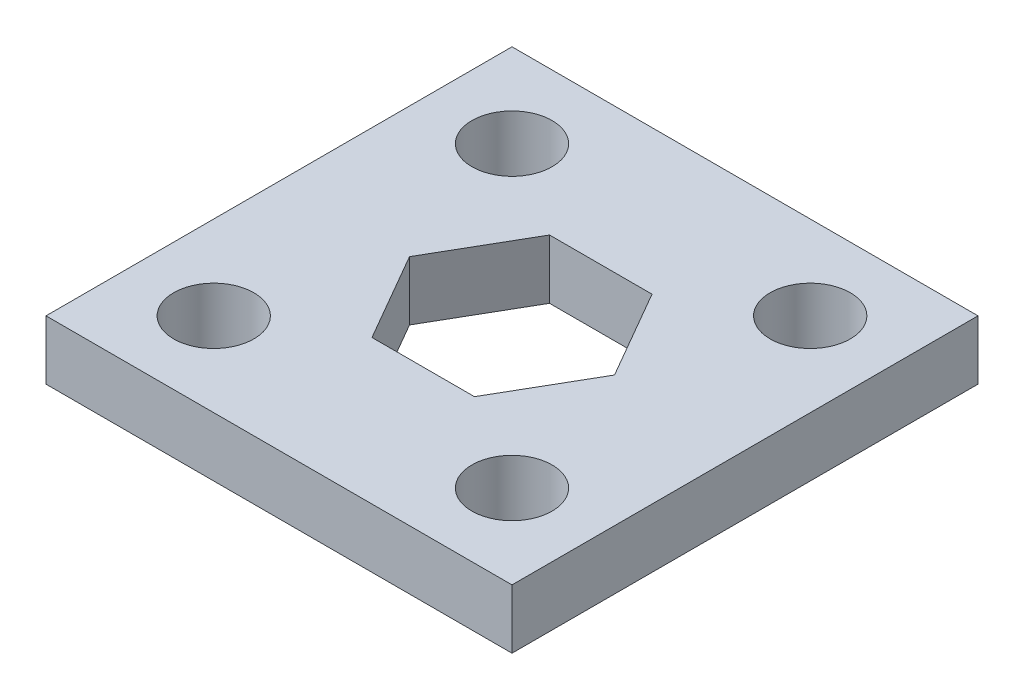
ISO-10303-21;
HEADER;
FILE_DESCRIPTION(('STEP AP214'),'2;1');
FILE_NAME('part.step','',(''),(''),'','','');
FILE_SCHEMA(('AUTOMOTIVE_DESIGN { 1 0 10303 214 1 1 1 1 }'));
ENDSEC;
DATA;
#1=APPLICATION_CONTEXT('core data for automotive mechanical design processes');
#2=APPLICATION_PROTOCOL_DEFINITION('international standard','automotive_design',2000,#1);
#3=PRODUCT_CONTEXT('',#1,'mechanical');
#4=PRODUCT('Part','Part','',(#3));
#5=PRODUCT_RELATED_PRODUCT_CATEGORY('part','',(#4));
#6=PRODUCT_DEFINITION_FORMATION('','',#4);
#7=PRODUCT_DEFINITION_CONTEXT('part definition',#1,'design');
#8=PRODUCT_DEFINITION('design','',#6,#7);
#9=PRODUCT_DEFINITION_SHAPE('','',#8);
#10=(LENGTH_UNIT() NAMED_UNIT(*) SI_UNIT(.MILLI.,.METRE.));
#11=(NAMED_UNIT(*) PLANE_ANGLE_UNIT() SI_UNIT($,.RADIAN.));
#12=(NAMED_UNIT(*) SI_UNIT($,.STERADIAN.) SOLID_ANGLE_UNIT());
#13=UNCERTAINTY_MEASURE_WITH_UNIT(LENGTH_MEASURE(1.E-05),#10,'distance_accuracy_value','');
#14=(GEOMETRIC_REPRESENTATION_CONTEXT(3) GLOBAL_UNCERTAINTY_ASSIGNED_CONTEXT((#13)) GLOBAL_UNIT_ASSIGNED_CONTEXT((#10,
#11,#12)) REPRESENTATION_CONTEXT('',''));
#15=CARTESIAN_POINT('',(0.,0.,0.));
#16=DIRECTION('',(0.,0.,1.));
#17=DIRECTION('',(1.,0.,0.));
#18=AXIS2_PLACEMENT_3D('',#15,#16,#17);
#19=CARTESIAN_POINT('',(0.,1.5875,0.));
#20=DIRECTION('',(0.,-1.,0.));
#21=DIRECTION('',(0.,0.,-1.));
#22=AXIS2_PLACEMENT_3D('',#19,#20,#21);
#23=PLANE('',#22);
#24=CARTESIAN_POINT('',(-8.,1.5875,8.));
#25=DIRECTION('',(0.,1.,0.));
#26=DIRECTION('',(0.,0.,1.));
#27=AXIS2_PLACEMENT_3D('',#24,#25,#26);
#28=CIRCLE('',#27,2.15);
#29=CARTESIAN_POINT('',(-8.,1.5875,10.15));
#30=VERTEX_POINT('',#29);
#31=EDGE_CURVE('E167',#30,#30,#28,.T.);
#32=ORIENTED_EDGE('',*,*,#31,.F.);
#33=EDGE_LOOP('',(#32));
#34=FACE_BOUND('',#33,.T.);
#35=CARTESIAN_POINT('',(8.,1.5875,8.));
#36=DIRECTION('',(0.,1.,0.));
#37=DIRECTION('',(0.,0.,1.));
#38=AXIS2_PLACEMENT_3D('',#35,#36,#37);
#39=CIRCLE('',#38,2.15);
#40=CARTESIAN_POINT('',(8.,1.5875,10.15));
#41=VERTEX_POINT('',#40);
#42=EDGE_CURVE('E173',#41,#41,#39,.T.);
#43=ORIENTED_EDGE('',*,*,#42,.F.);
#44=EDGE_LOOP('',(#43));
#45=FACE_BOUND('',#44,.T.);
#46=CARTESIAN_POINT('',(8.,1.5875,-8.));
#47=DIRECTION('',(0.,1.,0.));
#48=DIRECTION('',(0.,0.,1.));
#49=AXIS2_PLACEMENT_3D('',#46,#47,#48);
#50=CIRCLE('',#49,2.15);
#51=CARTESIAN_POINT('',(8.,1.5875,-5.85));
#52=VERTEX_POINT('',#51);
#53=EDGE_CURVE('E179',#52,#52,#50,.T.);
#54=ORIENTED_EDGE('',*,*,#53,.F.);
#55=EDGE_LOOP('',(#54));
#56=FACE_BOUND('',#55,.T.);
#57=CARTESIAN_POINT('',(-8.,1.5875,-8.));
#58=DIRECTION('',(0.,1.,0.));
#59=DIRECTION('',(0.,0.,1.));
#60=AXIS2_PLACEMENT_3D('',#57,#58,#59);
#61=CIRCLE('',#60,2.15);
#62=CARTESIAN_POINT('',(-8.,1.5875,-5.85));
#63=VERTEX_POINT('',#62);
#64=EDGE_CURVE('E185',#63,#63,#61,.T.);
#65=ORIENTED_EDGE('',*,*,#64,.F.);
#66=EDGE_LOOP('',(#65));
#67=FACE_BOUND('',#66,.T.);
#68=DIRECTION('',(0.,0.,-1.));
#69=VECTOR('',#68,1.);
#70=CARTESIAN_POINT('',(12.5,1.5875,12.5));
#71=LINE('',#70,#69);
#72=CARTESIAN_POINT('',(12.5,1.5875,12.5));
#73=VERTEX_POINT('',#72);
#74=CARTESIAN_POINT('',(12.5,1.5875,-12.5));
#75=VERTEX_POINT('',#74);
#76=EDGE_CURVE('E191',#73,#75,#71,.T.);
#77=ORIENTED_EDGE('',*,*,#76,.T.);
#78=DIRECTION('',(-1.,0.,0.));
#79=VECTOR('',#78,1.);
#80=CARTESIAN_POINT('',(-12.5,1.5875,-12.5));
#81=LINE('',#80,#79);
#82=CARTESIAN_POINT('',(-12.5,1.5875,-12.5));
#83=VERTEX_POINT('',#82);
#84=EDGE_CURVE('E194',#75,#83,#81,.T.);
#85=ORIENTED_EDGE('',*,*,#84,.T.);
#86=DIRECTION('',(0.,0.,1.));
#87=VECTOR('',#86,1.);
#88=CARTESIAN_POINT('',(-12.5,1.5875,12.5));
#89=LINE('',#88,#87);
#90=CARTESIAN_POINT('',(-12.5,1.5875,12.5));
#91=VERTEX_POINT('',#90);
#92=EDGE_CURVE('E197',#83,#91,#89,.T.);
#93=ORIENTED_EDGE('',*,*,#92,.T.);
#94=DIRECTION('',(1.,0.,0.));
#95=VECTOR('',#94,1.);
#96=CARTESIAN_POINT('',(-12.5,1.5875,12.5));
#97=LINE('',#96,#95);
#98=EDGE_CURVE('E199',#91,#73,#97,.T.);
#99=ORIENTED_EDGE('',*,*,#98,.T.);
#100=EDGE_LOOP('',(#77,#85,#93,#99));
#101=FACE_BOUND('',#100,.T.);
#102=DIRECTION('',(0.499999999999999,0.,0.866025403784439));
#103=VECTOR('',#102,1.);
#104=CARTESIAN_POINT('',(-5.49926131403117,1.5875,0.));
#105=LINE('',#104,#103);
#106=CARTESIAN_POINT('',(-5.49926131403117,1.5875,0.));
#107=VERTEX_POINT('',#106);
#108=CARTESIAN_POINT('',(-2.74963065701559,1.5875,4.7625));
#109=VERTEX_POINT('',#108);
#110=EDGE_CURVE('E116',#107,#109,#105,.T.);
#111=ORIENTED_EDGE('',*,*,#110,.F.);
#112=DIRECTION('',(-0.499999999999998,0.,0.86602540378444));
#113=VECTOR('',#112,1.);
#114=CARTESIAN_POINT('',(-2.74963065701559,1.5875,-4.76250000000001));
#115=LINE('',#114,#113);
#116=CARTESIAN_POINT('',(-2.74963065701559,1.5875,-4.76250000000001));
#117=VERTEX_POINT('',#116);
#118=EDGE_CURVE('E145',#117,#107,#115,.T.);
#119=ORIENTED_EDGE('',*,*,#118,.F.);
#120=DIRECTION('',(-1.,0.,0.));
#121=VECTOR('',#120,1.);
#122=CARTESIAN_POINT('',(2.74963065701559,1.5875,-4.76250000000001));
#123=LINE('',#122,#121);
#124=CARTESIAN_POINT('',(2.74963065701559,1.5875,-4.76250000000001));
#125=VERTEX_POINT('',#124);
#126=EDGE_CURVE('E143',#125,#117,#123,.T.);
#127=ORIENTED_EDGE('',*,*,#126,.F.);
#128=DIRECTION('',(-0.499999999999998,0.,-0.86602540378444));
#129=VECTOR('',#128,1.);
#130=CARTESIAN_POINT('',(5.49926131403117,1.5875,0.));
#131=LINE('',#130,#129);
#132=CARTESIAN_POINT('',(5.49926131403117,1.5875,0.));
#133=VERTEX_POINT('',#132);
#134=EDGE_CURVE('E139',#133,#125,#131,.T.);
#135=ORIENTED_EDGE('',*,*,#134,.F.);
#136=DIRECTION('',(0.499999999999999,0.,-0.866025403784439));
#137=VECTOR('',#136,1.);
#138=CARTESIAN_POINT('',(2.74963065701559,1.5875,4.7625));
#139=LINE('',#138,#137);
#140=CARTESIAN_POINT('',(2.74963065701559,1.5875,4.7625));
#141=VERTEX_POINT('',#140);
#142=EDGE_CURVE('E137',#141,#133,#139,.T.);
#143=ORIENTED_EDGE('',*,*,#142,.F.);
#144=DIRECTION('',(1.,0.,0.));
#145=VECTOR('',#144,1.);
#146=CARTESIAN_POINT('',(-2.74963065701559,1.5875,4.7625));
#147=LINE('',#146,#145);
#148=EDGE_CURVE('E124',#109,#141,#147,.T.);
#149=ORIENTED_EDGE('',*,*,#148,.F.);
#150=EDGE_LOOP('',(#111,#119,#127,#135,#143,#149));
#151=FACE_BOUND('',#150,.T.);
#152=ADVANCED_FACE('F39',(#34,#45,#56,#67,#101,#151),#23,.F.);
#153=CARTESIAN_POINT('',(0.,-1.5875,0.));
#154=DIRECTION('',(0.,-1.,0.));
#155=DIRECTION('',(0.,0.,-1.));
#156=AXIS2_PLACEMENT_3D('',#153,#154,#155);
#157=PLANE('',#156);
#158=CARTESIAN_POINT('',(8.,-1.5875,8.));
#159=DIRECTION('',(0.,1.,0.));
#160=DIRECTION('',(0.,0.,1.));
#161=AXIS2_PLACEMENT_3D('',#158,#159,#160);
#162=CIRCLE('',#161,2.15);
#163=CARTESIAN_POINT('',(8.,-1.5875,10.15));
#164=VERTEX_POINT('',#163);
#165=EDGE_CURVE('E170',#164,#164,#162,.T.);
#166=ORIENTED_EDGE('',*,*,#165,.T.);
#167=EDGE_LOOP('',(#166));
#168=FACE_BOUND('',#167,.T.);
#169=CARTESIAN_POINT('',(-8.,-1.5875,-8.));
#170=DIRECTION('',(0.,1.,0.));
#171=DIRECTION('',(0.,0.,1.));
#172=AXIS2_PLACEMENT_3D('',#169,#170,#171);
#173=CIRCLE('',#172,2.15);
#174=CARTESIAN_POINT('',(-8.,-1.5875,-5.85));
#175=VERTEX_POINT('',#174);
#176=EDGE_CURVE('E182',#175,#175,#173,.T.);
#177=ORIENTED_EDGE('',*,*,#176,.T.);
#178=EDGE_LOOP('',(#177));
#179=FACE_BOUND('',#178,.T.);
#180=DIRECTION('',(0.,0.,-1.));
#181=VECTOR('',#180,1.);
#182=CARTESIAN_POINT('',(12.5,-1.5875,12.5));
#183=LINE('',#182,#181);
#184=CARTESIAN_POINT('',(12.5,-1.5875,12.5));
#185=VERTEX_POINT('',#184);
#186=CARTESIAN_POINT('',(12.5,-1.5875,-12.5));
#187=VERTEX_POINT('',#186);
#188=EDGE_CURVE('E188',#185,#187,#183,.T.);
#189=ORIENTED_EDGE('',*,*,#188,.F.);
#190=DIRECTION('',(1.,0.,0.));
#191=VECTOR('',#190,1.);
#192=CARTESIAN_POINT('',(-12.5,-1.5875,12.5));
#193=LINE('',#192,#191);
#194=CARTESIAN_POINT('',(-12.5,-1.5875,12.5));
#195=VERTEX_POINT('',#194);
#196=EDGE_CURVE('E195',#195,#185,#193,.T.);
#197=ORIENTED_EDGE('',*,*,#196,.F.);
#198=DIRECTION('',(0.,0.,1.));
#199=VECTOR('',#198,1.);
#200=CARTESIAN_POINT('',(-12.5,-1.5875,12.5));
#201=LINE('',#200,#199);
#202=CARTESIAN_POINT('',(-12.5,-1.5875,-12.5));
#203=VERTEX_POINT('',#202);
#204=EDGE_CURVE('E206',#203,#195,#201,.T.);
#205=ORIENTED_EDGE('',*,*,#204,.F.);
#206=DIRECTION('',(-1.,0.,0.));
#207=VECTOR('',#206,1.);
#208=CARTESIAN_POINT('',(-12.5,-1.5875,-12.5));
#209=LINE('',#208,#207);
#210=EDGE_CURVE('E204',#187,#203,#209,.T.);
#211=ORIENTED_EDGE('',*,*,#210,.F.);
#212=EDGE_LOOP('',(#189,#197,#205,#211));
#213=FACE_BOUND('',#212,.T.);
#214=CARTESIAN_POINT('',(8.,-1.5875,-8.));
#215=DIRECTION('',(0.,1.,0.));
#216=DIRECTION('',(0.,0.,1.));
#217=AXIS2_PLACEMENT_3D('',#214,#215,#216);
#218=CIRCLE('',#217,2.15);
#219=CARTESIAN_POINT('',(8.,-1.5875,-5.85));
#220=VERTEX_POINT('',#219);
#221=EDGE_CURVE('E176',#220,#220,#218,.T.);
#222=ORIENTED_EDGE('',*,*,#221,.T.);
#223=EDGE_LOOP('',(#222));
#224=FACE_BOUND('',#223,.T.);
#225=CARTESIAN_POINT('',(-8.,-1.5875,8.));
#226=DIRECTION('',(0.,1.,0.));
#227=DIRECTION('',(0.,0.,1.));
#228=AXIS2_PLACEMENT_3D('',#225,#226,#227);
#229=CIRCLE('',#228,2.15);
#230=CARTESIAN_POINT('',(-8.,-1.5875,10.15));
#231=VERTEX_POINT('',#230);
#232=EDGE_CURVE('E132',#231,#231,#229,.T.);
#233=ORIENTED_EDGE('',*,*,#232,.T.);
#234=EDGE_LOOP('',(#233));
#235=FACE_BOUND('',#234,.T.);
#236=DIRECTION('',(-0.499999999999998,0.,0.86602540378444));
#237=VECTOR('',#236,1.);
#238=CARTESIAN_POINT('',(-2.74963065701559,-1.5875,-4.76250000000001));
#239=LINE('',#238,#237);
#240=CARTESIAN_POINT('',(-2.74963065701559,-1.5875,-4.76250000000001));
#241=VERTEX_POINT('',#240);
#242=CARTESIAN_POINT('',(-5.49926131403117,-1.5875,0.));
#243=VERTEX_POINT('',#242);
#244=EDGE_CURVE('E125',#241,#243,#239,.T.);
#245=ORIENTED_EDGE('',*,*,#244,.T.);
#246=DIRECTION('',(0.499999999999999,0.,0.866025403784439));
#247=VECTOR('',#246,1.);
#248=CARTESIAN_POINT('',(-5.49926131403117,-1.5875,0.));
#249=LINE('',#248,#247);
#250=CARTESIAN_POINT('',(-2.74963065701559,-1.5875,4.7625));
#251=VERTEX_POINT('',#250);
#252=EDGE_CURVE('E62',#243,#251,#249,.T.);
#253=ORIENTED_EDGE('',*,*,#252,.T.);
#254=DIRECTION('',(1.,0.,0.));
#255=VECTOR('',#254,1.);
#256=CARTESIAN_POINT('',(-2.74963065701559,-1.5875,4.7625));
#257=LINE('',#256,#255);
#258=CARTESIAN_POINT('',(2.74963065701559,-1.5875,4.7625));
#259=VERTEX_POINT('',#258);
#260=EDGE_CURVE('E131',#251,#259,#257,.T.);
#261=ORIENTED_EDGE('',*,*,#260,.T.);
#262=DIRECTION('',(0.499999999999999,0.,-0.866025403784439));
#263=VECTOR('',#262,1.);
#264=CARTESIAN_POINT('',(2.74963065701559,-1.5875,4.7625));
#265=LINE('',#264,#263);
#266=CARTESIAN_POINT('',(5.49926131403117,-1.5875,0.));
#267=VERTEX_POINT('',#266);
#268=EDGE_CURVE('E149',#259,#267,#265,.T.);
#269=ORIENTED_EDGE('',*,*,#268,.T.);
#270=DIRECTION('',(-0.499999999999998,0.,-0.86602540378444));
#271=VECTOR('',#270,1.);
#272=CARTESIAN_POINT('',(5.49926131403117,-1.5875,0.));
#273=LINE('',#272,#271);
#274=CARTESIAN_POINT('',(2.74963065701559,-1.5875,-4.76250000000001));
#275=VERTEX_POINT('',#274);
#276=EDGE_CURVE('E152',#267,#275,#273,.T.);
#277=ORIENTED_EDGE('',*,*,#276,.T.);
#278=DIRECTION('',(-1.,0.,0.));
#279=VECTOR('',#278,1.);
#280=CARTESIAN_POINT('',(2.74963065701559,-1.5875,-4.76250000000001));
#281=LINE('',#280,#279);
#282=EDGE_CURVE('E155',#275,#241,#281,.T.);
#283=ORIENTED_EDGE('',*,*,#282,.T.);
#284=EDGE_LOOP('',(#245,#253,#261,#269,#277,#283));
#285=FACE_BOUND('',#284,.T.);
#286=ADVANCED_FACE('F224',(#168,#179,#213,#224,#235,#285),#157,.T.);
#287=CARTESIAN_POINT('',(12.5,1.5875,12.5));
#288=DIRECTION('',(-1.,0.,0.));
#289=DIRECTION('',(0.,0.,1.));
#290=AXIS2_PLACEMENT_3D('',#287,#288,#289);
#291=PLANE('',#290);
#292=ORIENTED_EDGE('',*,*,#188,.T.);
#293=DIRECTION('',(0.,-1.,0.));
#294=VECTOR('',#293,1.);
#295=CARTESIAN_POINT('',(12.5,1.5875,-12.5));
#296=LINE('',#295,#294);
#297=EDGE_CURVE('E11',#75,#187,#296,.T.);
#298=ORIENTED_EDGE('',*,*,#297,.F.);
#299=ORIENTED_EDGE('',*,*,#76,.F.);
#300=DIRECTION('',(0.,-1.,0.));
#301=VECTOR('',#300,1.);
#302=CARTESIAN_POINT('',(12.5,1.5875,12.5));
#303=LINE('',#302,#301);
#304=EDGE_CURVE('E201',#73,#185,#303,.T.);
#305=ORIENTED_EDGE('',*,*,#304,.T.);
#306=EDGE_LOOP('',(#292,#298,#299,#305));
#307=FACE_BOUND('',#306,.T.);
#308=ADVANCED_FACE('F41',(#307),#291,.F.);
#309=CARTESIAN_POINT('',(-12.5,1.5875,-12.5));
#310=DIRECTION('',(0.,0.,1.));
#311=DIRECTION('',(1.,0.,0.));
#312=AXIS2_PLACEMENT_3D('',#309,#310,#311);
#313=PLANE('',#312);
#314=ORIENTED_EDGE('',*,*,#210,.T.);
#315=DIRECTION('',(0.,-1.,0.));
#316=VECTOR('',#315,1.);
#317=CARTESIAN_POINT('',(-12.5,1.5875,-12.5));
#318=LINE('',#317,#316);
#319=EDGE_CURVE('E47',#83,#203,#318,.T.);
#320=ORIENTED_EDGE('',*,*,#319,.F.);
#321=ORIENTED_EDGE('',*,*,#84,.F.);
#322=ORIENTED_EDGE('',*,*,#297,.T.);
#323=EDGE_LOOP('',(#314,#320,#321,#322));
#324=FACE_BOUND('',#323,.T.);
#325=ADVANCED_FACE('F234',(#324),#313,.F.);
#326=CARTESIAN_POINT('',(-12.5,1.5875,12.5));
#327=DIRECTION('',(1.,0.,0.));
#328=DIRECTION('',(0.,0.,-1.));
#329=AXIS2_PLACEMENT_3D('',#326,#327,#328);
#330=PLANE('',#329);
#331=ORIENTED_EDGE('',*,*,#204,.T.);
#332=DIRECTION('',(0.,-1.,0.));
#333=VECTOR('',#332,1.);
#334=CARTESIAN_POINT('',(-12.5,1.5875,12.5));
#335=LINE('',#334,#333);
#336=EDGE_CURVE('E211',#91,#195,#335,.T.);
#337=ORIENTED_EDGE('',*,*,#336,.F.);
#338=ORIENTED_EDGE('',*,*,#92,.F.);
#339=ORIENTED_EDGE('',*,*,#319,.T.);
#340=EDGE_LOOP('',(#331,#337,#338,#339));
#341=FACE_BOUND('',#340,.T.);
#342=ADVANCED_FACE('F218',(#341),#330,.F.);
#343=CARTESIAN_POINT('',(-12.5,1.5875,12.5));
#344=DIRECTION('',(0.,0.,-1.));
#345=DIRECTION('',(-1.,0.,0.));
#346=AXIS2_PLACEMENT_3D('',#343,#344,#345);
#347=PLANE('',#346);
#348=ORIENTED_EDGE('',*,*,#196,.T.);
#349=ORIENTED_EDGE('',*,*,#304,.F.);
#350=ORIENTED_EDGE('',*,*,#98,.F.);
#351=ORIENTED_EDGE('',*,*,#336,.T.);
#352=EDGE_LOOP('',(#348,#349,#350,#351));
#353=FACE_BOUND('',#352,.T.);
#354=ADVANCED_FACE('F228',(#353),#347,.F.);
#355=CARTESIAN_POINT('',(-8.,1.5875,-8.));
#356=DIRECTION('',(0.,-1.,0.));
#357=DIRECTION('',(0.,0.,-1.));
#358=AXIS2_PLACEMENT_3D('',#355,#356,#357);
#359=CYLINDRICAL_SURFACE('',#358,2.15);
#360=ORIENTED_EDGE('',*,*,#64,.T.);
#361=EDGE_LOOP('',(#360));
#362=FACE_BOUND('',#361,.T.);
#363=ORIENTED_EDGE('',*,*,#176,.F.);
#364=EDGE_LOOP('',(#363));
#365=FACE_BOUND('',#364,.T.);
#366=ADVANCED_FACE('F252',(#362,#365),#359,.F.);
#367=CARTESIAN_POINT('',(8.,1.5875,-8.));
#368=DIRECTION('',(0.,-1.,0.));
#369=DIRECTION('',(0.,0.,-1.));
#370=AXIS2_PLACEMENT_3D('',#367,#368,#369);
#371=CYLINDRICAL_SURFACE('',#370,2.15);
#372=ORIENTED_EDGE('',*,*,#53,.T.);
#373=EDGE_LOOP('',(#372));
#374=FACE_BOUND('',#373,.T.);
#375=ORIENTED_EDGE('',*,*,#221,.F.);
#376=EDGE_LOOP('',(#375));
#377=FACE_BOUND('',#376,.T.);
#378=ADVANCED_FACE('F259',(#374,#377),#371,.F.);
#379=CARTESIAN_POINT('',(8.,1.5875,8.));
#380=DIRECTION('',(0.,-1.,0.));
#381=DIRECTION('',(0.,0.,-1.));
#382=AXIS2_PLACEMENT_3D('',#379,#380,#381);
#383=CYLINDRICAL_SURFACE('',#382,2.15);
#384=ORIENTED_EDGE('',*,*,#42,.T.);
#385=EDGE_LOOP('',(#384));
#386=FACE_BOUND('',#385,.T.);
#387=ORIENTED_EDGE('',*,*,#165,.F.);
#388=EDGE_LOOP('',(#387));
#389=FACE_BOUND('',#388,.T.);
#390=ADVANCED_FACE('F264',(#386,#389),#383,.F.);
#391=CARTESIAN_POINT('',(-8.,1.5875,8.));
#392=DIRECTION('',(0.,-1.,0.));
#393=DIRECTION('',(0.,0.,-1.));
#394=AXIS2_PLACEMENT_3D('',#391,#392,#393);
#395=CYLINDRICAL_SURFACE('',#394,2.15);
#396=ORIENTED_EDGE('',*,*,#31,.T.);
#397=EDGE_LOOP('',(#396));
#398=FACE_BOUND('',#397,.T.);
#399=ORIENTED_EDGE('',*,*,#232,.F.);
#400=EDGE_LOOP('',(#399));
#401=FACE_BOUND('',#400,.T.);
#402=ADVANCED_FACE('F274',(#398,#401),#395,.F.);
#403=CARTESIAN_POINT('',(-5.49926131403117,1.5875,0.));
#404=DIRECTION('',(0.866025403784439,0.,-0.499999999999999));
#405=DIRECTION('',(-0.499999999999999,0.,-0.866025403784439));
#406=AXIS2_PLACEMENT_3D('',#403,#404,#405);
#407=PLANE('',#406);
#408=ORIENTED_EDGE('',*,*,#252,.F.);
#409=DIRECTION('',(0.,-1.,0.));
#410=VECTOR('',#409,1.);
#411=CARTESIAN_POINT('',(-5.49926131403117,1.5875,0.));
#412=LINE('',#411,#410);
#413=EDGE_CURVE('E120',#107,#243,#412,.T.);
#414=ORIENTED_EDGE('',*,*,#413,.F.);
#415=ORIENTED_EDGE('',*,*,#110,.T.);
#416=DIRECTION('',(0.,-1.,0.));
#417=VECTOR('',#416,1.);
#418=CARTESIAN_POINT('',(-2.74963065701559,1.5875,4.7625));
#419=LINE('',#418,#417);
#420=EDGE_CURVE('E119',#109,#251,#419,.T.);
#421=ORIENTED_EDGE('',*,*,#420,.T.);
#422=EDGE_LOOP('',(#408,#414,#415,#421));
#423=FACE_BOUND('',#422,.T.);
#424=ADVANCED_FACE('F118',(#423),#407,.T.);
#425=CARTESIAN_POINT('',(-2.74963065701559,1.5875,4.7625));
#426=DIRECTION('',(0.,0.,-1.));
#427=DIRECTION('',(-1.,0.,0.));
#428=AXIS2_PLACEMENT_3D('',#425,#426,#427);
#429=PLANE('',#428);
#430=ORIENTED_EDGE('',*,*,#260,.F.);
#431=ORIENTED_EDGE('',*,*,#420,.F.);
#432=ORIENTED_EDGE('',*,*,#148,.T.);
#433=DIRECTION('',(0.,-1.,0.));
#434=VECTOR('',#433,1.);
#435=CARTESIAN_POINT('',(2.74963065701559,1.5875,4.7625));
#436=LINE('',#435,#434);
#437=EDGE_CURVE('E133',#141,#259,#436,.T.);
#438=ORIENTED_EDGE('',*,*,#437,.T.);
#439=EDGE_LOOP('',(#430,#431,#432,#438));
#440=FACE_BOUND('',#439,.T.);
#441=ADVANCED_FACE('F128',(#440),#429,.T.);
#442=CARTESIAN_POINT('',(2.74963065701559,1.5875,4.7625));
#443=DIRECTION('',(-0.866025403784439,0.,-0.499999999999999));
#444=DIRECTION('',(-0.499999999999999,0.,0.86602540378444));
#445=AXIS2_PLACEMENT_3D('',#442,#443,#444);
#446=PLANE('',#445);
#447=ORIENTED_EDGE('',*,*,#268,.F.);
#448=ORIENTED_EDGE('',*,*,#437,.F.);
#449=ORIENTED_EDGE('',*,*,#142,.T.);
#450=DIRECTION('',(0.,-1.,0.));
#451=VECTOR('',#450,1.);
#452=CARTESIAN_POINT('',(5.49926131403117,1.5875,0.));
#453=LINE('',#452,#451);
#454=EDGE_CURVE('E164',#133,#267,#453,.T.);
#455=ORIENTED_EDGE('',*,*,#454,.T.);
#456=EDGE_LOOP('',(#447,#448,#449,#455));
#457=FACE_BOUND('',#456,.T.);
#458=ADVANCED_FACE('F286',(#457),#446,.T.);
#459=CARTESIAN_POINT('',(5.49926131403117,1.5875,0.));
#460=DIRECTION('',(-0.86602540378444,0.,0.499999999999998));
#461=DIRECTION('',(0.499999999999998,0.,0.86602540378444));
#462=AXIS2_PLACEMENT_3D('',#459,#460,#461);
#463=PLANE('',#462);
#464=ORIENTED_EDGE('',*,*,#276,.F.);
#465=ORIENTED_EDGE('',*,*,#454,.F.);
#466=ORIENTED_EDGE('',*,*,#134,.T.);
#467=DIRECTION('',(0.,-1.,0.));
#468=VECTOR('',#467,1.);
#469=CARTESIAN_POINT('',(2.74963065701559,1.5875,-4.76250000000001));
#470=LINE('',#469,#468);
#471=EDGE_CURVE('E162',#125,#275,#470,.T.);
#472=ORIENTED_EDGE('',*,*,#471,.T.);
#473=EDGE_LOOP('',(#464,#465,#466,#472));
#474=FACE_BOUND('',#473,.T.);
#475=ADVANCED_FACE('F289',(#474),#463,.T.);
#476=CARTESIAN_POINT('',(2.74963065701559,1.5875,-4.76250000000001));
#477=DIRECTION('',(0.,0.,1.));
#478=DIRECTION('',(1.,0.,0.));
#479=AXIS2_PLACEMENT_3D('',#476,#477,#478);
#480=PLANE('',#479);
#481=ORIENTED_EDGE('',*,*,#282,.F.);
#482=ORIENTED_EDGE('',*,*,#471,.F.);
#483=ORIENTED_EDGE('',*,*,#126,.T.);
#484=DIRECTION('',(0.,-1.,0.));
#485=VECTOR('',#484,1.);
#486=CARTESIAN_POINT('',(-2.74963065701559,1.5875,-4.76250000000001));
#487=LINE('',#486,#485);
#488=EDGE_CURVE('E54',#117,#241,#487,.T.);
#489=ORIENTED_EDGE('',*,*,#488,.T.);
#490=EDGE_LOOP('',(#481,#482,#483,#489));
#491=FACE_BOUND('',#490,.T.);
#492=ADVANCED_FACE('F293',(#491),#480,.T.);
#493=CARTESIAN_POINT('',(-2.74963065701559,1.5875,-4.76250000000001));
#494=DIRECTION('',(0.86602540378444,0.,0.499999999999998));
#495=DIRECTION('',(0.499999999999998,0.,-0.86602540378444));
#496=AXIS2_PLACEMENT_3D('',#493,#494,#495);
#497=PLANE('',#496);
#498=ORIENTED_EDGE('',*,*,#244,.F.);
#499=ORIENTED_EDGE('',*,*,#488,.F.);
#500=ORIENTED_EDGE('',*,*,#118,.T.);
#501=ORIENTED_EDGE('',*,*,#413,.T.);
#502=EDGE_LOOP('',(#498,#499,#500,#501));
#503=FACE_BOUND('',#502,.T.);
#504=ADVANCED_FACE('F297',(#503),#497,.T.);
#505=CLOSED_SHELL('',(#152,#286,#308,#325,#342,#354,#366,#378,#390,#402,#424,#441,#458,#475,
#492,#504));
#506=MANIFOLD_SOLID_BREP('B2',#505);
#507=ADVANCED_BREP_SHAPE_REPRESENTATION('',(#18,#506),#14);
#508=SHAPE_DEFINITION_REPRESENTATION(#9,#507);
ENDSEC;
END-ISO-10303-21;
